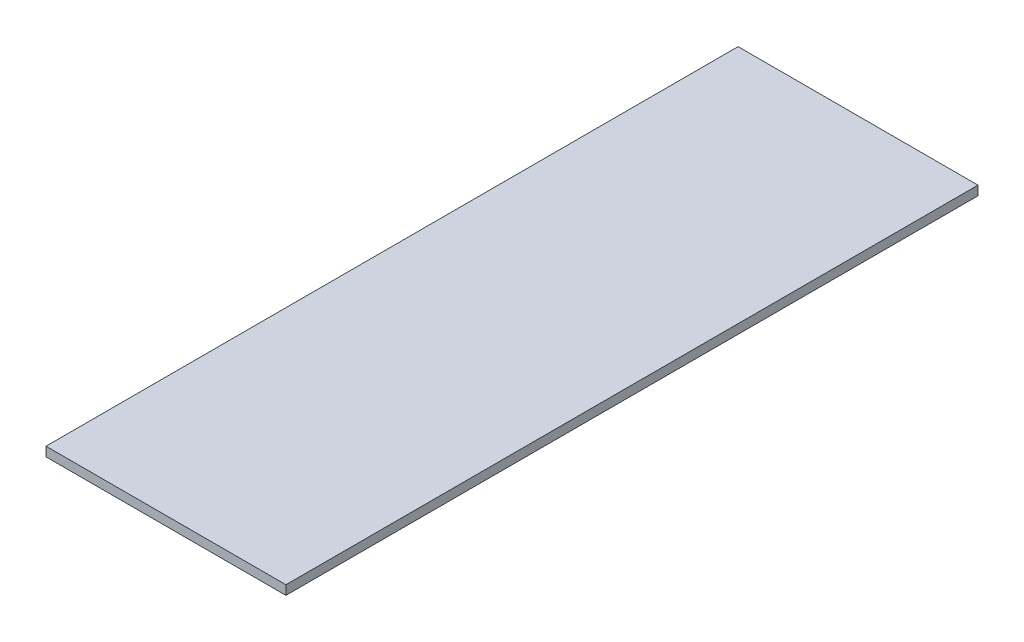
ISO-10303-21;
HEADER;
FILE_DESCRIPTION(('STEP AP214'),'2;1');
FILE_NAME('part.step','',(''),(''),'','','');
FILE_SCHEMA(('AUTOMOTIVE_DESIGN { 1 0 10303 214 1 1 1 1 }'));
ENDSEC;
DATA;
#1=APPLICATION_CONTEXT('core data for automotive mechanical design processes');
#2=APPLICATION_PROTOCOL_DEFINITION('international standard','automotive_design',2000,#1);
#3=PRODUCT_CONTEXT('',#1,'mechanical');
#4=PRODUCT('Part','Part','',(#3));
#5=PRODUCT_RELATED_PRODUCT_CATEGORY('part','',(#4));
#6=PRODUCT_DEFINITION_FORMATION('','',#4);
#7=PRODUCT_DEFINITION_CONTEXT('part definition',#1,'design');
#8=PRODUCT_DEFINITION('design','',#6,#7);
#9=PRODUCT_DEFINITION_SHAPE('','',#8);
#10=(LENGTH_UNIT() NAMED_UNIT(*) SI_UNIT(.MILLI.,.METRE.));
#11=(NAMED_UNIT(*) PLANE_ANGLE_UNIT() SI_UNIT($,.RADIAN.));
#12=(NAMED_UNIT(*) SI_UNIT($,.STERADIAN.) SOLID_ANGLE_UNIT());
#13=UNCERTAINTY_MEASURE_WITH_UNIT(LENGTH_MEASURE(1.E-05),#10,'distance_accuracy_value','');
#14=(GEOMETRIC_REPRESENTATION_CONTEXT(3) GLOBAL_UNCERTAINTY_ASSIGNED_CONTEXT((#13)) GLOBAL_UNIT_ASSIGNED_CONTEXT((#10,
#11,#12)) REPRESENTATION_CONTEXT('',''));
#15=CARTESIAN_POINT('',(0.,0.,0.));
#16=DIRECTION('',(0.,0.,1.));
#17=DIRECTION('',(1.,0.,0.));
#18=AXIS2_PLACEMENT_3D('',#15,#16,#17);
#19=CARTESIAN_POINT('',(-13.,26.5,-30.));
#20=DIRECTION('',(1.,0.,0.));
#21=DIRECTION('',(0.,0.,-1.));
#22=AXIS2_PLACEMENT_3D('',#19,#20,#21);
#23=PLANE('',#22);
#24=DIRECTION('',(0.,0.,1.));
#25=VECTOR('',#24,1.);
#26=CARTESIAN_POINT('',(-13.,25.5,-30.));
#27=LINE('',#26,#25);
#28=CARTESIAN_POINT('',(-13.,25.5,-30.));
#29=VERTEX_POINT('',#28);
#30=CARTESIAN_POINT('',(-13.,25.5,45.));
#31=VERTEX_POINT('',#30);
#32=EDGE_CURVE('E100',#29,#31,#27,.T.);
#33=ORIENTED_EDGE('',*,*,#32,.T.);
#34=DIRECTION('',(0.,-1.,0.));
#35=VECTOR('',#34,1.);
#36=CARTESIAN_POINT('',(-13.,26.5,45.));
#37=LINE('',#36,#35);
#38=CARTESIAN_POINT('',(-13.,26.5,45.));
#39=VERTEX_POINT('',#38);
#40=EDGE_CURVE('E11',#39,#31,#37,.T.);
#41=ORIENTED_EDGE('',*,*,#40,.F.);
#42=DIRECTION('',(0.,0.,1.));
#43=VECTOR('',#42,1.);
#44=CARTESIAN_POINT('',(-13.,26.5,-30.));
#45=LINE('',#44,#43);
#46=CARTESIAN_POINT('',(-13.,26.5,-30.));
#47=VERTEX_POINT('',#46);
#48=EDGE_CURVE('E86',#47,#39,#45,.T.);
#49=ORIENTED_EDGE('',*,*,#48,.F.);
#50=DIRECTION('',(0.,-1.,0.));
#51=VECTOR('',#50,1.);
#52=CARTESIAN_POINT('',(-13.,26.5,-30.));
#53=LINE('',#52,#51);
#54=EDGE_CURVE('E53',#47,#29,#53,.T.);
#55=ORIENTED_EDGE('',*,*,#54,.T.);
#56=EDGE_LOOP('',(#33,#41,#49,#55));
#57=FACE_BOUND('',#56,.T.);
#58=ADVANCED_FACE('F37',(#57),#23,.F.);
#59=CARTESIAN_POINT('',(-13.,26.5,45.));
#60=DIRECTION('',(0.,0.,-1.));
#61=DIRECTION('',(-1.,0.,0.));
#62=AXIS2_PLACEMENT_3D('',#59,#60,#61);
#63=PLANE('',#62);
#64=DIRECTION('',(1.,0.,0.));
#65=VECTOR('',#64,1.);
#66=CARTESIAN_POINT('',(-13.,25.5,45.));
#67=LINE('',#66,#65);
#68=CARTESIAN_POINT('',(13.,25.5,45.));
#69=VERTEX_POINT('',#68);
#70=EDGE_CURVE('E91',#31,#69,#67,.T.);
#71=ORIENTED_EDGE('',*,*,#70,.T.);
#72=DIRECTION('',(0.,-1.,0.));
#73=VECTOR('',#72,1.);
#74=CARTESIAN_POINT('',(13.,26.5,45.));
#75=LINE('',#74,#73);
#76=CARTESIAN_POINT('',(13.,26.5,45.));
#77=VERTEX_POINT('',#76);
#78=EDGE_CURVE('E45',#77,#69,#75,.T.);
#79=ORIENTED_EDGE('',*,*,#78,.F.);
#80=DIRECTION('',(1.,0.,0.));
#81=VECTOR('',#80,1.);
#82=CARTESIAN_POINT('',(-13.,26.5,45.));
#83=LINE('',#82,#81);
#84=EDGE_CURVE('E78',#39,#77,#83,.T.);
#85=ORIENTED_EDGE('',*,*,#84,.F.);
#86=ORIENTED_EDGE('',*,*,#40,.T.);
#87=EDGE_LOOP('',(#71,#79,#85,#86));
#88=FACE_BOUND('',#87,.T.);
#89=ADVANCED_FACE('F90',(#88),#63,.F.);
#90=CARTESIAN_POINT('',(13.,26.5,-30.));
#91=DIRECTION('',(1.,0.,0.));
#92=DIRECTION('',(0.,0.,-1.));
#93=AXIS2_PLACEMENT_3D('',#90,#91,#92);
#94=PLANE('',#93);
#95=DIRECTION('',(0.,0.,1.));
#96=VECTOR('',#95,1.);
#97=CARTESIAN_POINT('',(13.,25.5,-30.));
#98=LINE('',#97,#96);
#99=CARTESIAN_POINT('',(13.,25.5,-30.));
#100=VERTEX_POINT('',#99);
#101=EDGE_CURVE('E103',#100,#69,#98,.T.);
#102=ORIENTED_EDGE('',*,*,#101,.F.);
#103=DIRECTION('',(0.,-1.,0.));
#104=VECTOR('',#103,1.);
#105=CARTESIAN_POINT('',(13.,26.5,-30.));
#106=LINE('',#105,#104);
#107=CARTESIAN_POINT('',(13.,26.5,-30.));
#108=VERTEX_POINT('',#107);
#109=EDGE_CURVE('E67',#108,#100,#106,.T.);
#110=ORIENTED_EDGE('',*,*,#109,.F.);
#111=DIRECTION('',(0.,0.,1.));
#112=VECTOR('',#111,1.);
#113=CARTESIAN_POINT('',(13.,26.5,-30.));
#114=LINE('',#113,#112);
#115=EDGE_CURVE('E85',#108,#77,#114,.T.);
#116=ORIENTED_EDGE('',*,*,#115,.T.);
#117=ORIENTED_EDGE('',*,*,#78,.T.);
#118=EDGE_LOOP('',(#102,#110,#116,#117));
#119=FACE_BOUND('',#118,.T.);
#120=ADVANCED_FACE('F94',(#119),#94,.T.);
#121=CARTESIAN_POINT('',(-13.,26.5,-30.));
#122=DIRECTION('',(0.,0.,-1.));
#123=DIRECTION('',(-1.,0.,0.));
#124=AXIS2_PLACEMENT_3D('',#121,#122,#123);
#125=PLANE('',#124);
#126=DIRECTION('',(1.,0.,0.));
#127=VECTOR('',#126,1.);
#128=CARTESIAN_POINT('',(-13.,25.5,-30.));
#129=LINE('',#128,#127);
#130=EDGE_CURVE('E105',#29,#100,#129,.T.);
#131=ORIENTED_EDGE('',*,*,#130,.F.);
#132=ORIENTED_EDGE('',*,*,#54,.F.);
#133=DIRECTION('',(1.,0.,0.));
#134=VECTOR('',#133,1.);
#135=CARTESIAN_POINT('',(-13.,26.5,-30.));
#136=LINE('',#135,#134);
#137=EDGE_CURVE('E95',#47,#108,#136,.T.);
#138=ORIENTED_EDGE('',*,*,#137,.T.);
#139=ORIENTED_EDGE('',*,*,#109,.T.);
#140=EDGE_LOOP('',(#131,#132,#138,#139));
#141=FACE_BOUND('',#140,.T.);
#142=ADVANCED_FACE('F111',(#141),#125,.T.);
#143=CARTESIAN_POINT('',(0.,26.5,0.));
#144=DIRECTION('',(0.,1.,0.));
#145=DIRECTION('',(0.,0.,1.));
#146=AXIS2_PLACEMENT_3D('',#143,#144,#145);
#147=PLANE('',#146);
#148=ORIENTED_EDGE('',*,*,#48,.T.);
#149=ORIENTED_EDGE('',*,*,#84,.T.);
#150=ORIENTED_EDGE('',*,*,#115,.F.);
#151=ORIENTED_EDGE('',*,*,#137,.F.);
#152=EDGE_LOOP('',(#148,#149,#150,#151));
#153=FACE_BOUND('',#152,.T.);
#154=ADVANCED_FACE('F82',(#153),#147,.T.);
#155=CARTESIAN_POINT('',(0.,25.5,0.));
#156=DIRECTION('',(0.,1.,0.));
#157=DIRECTION('',(0.,0.,1.));
#158=AXIS2_PLACEMENT_3D('',#155,#156,#157);
#159=PLANE('',#158);
#160=ORIENTED_EDGE('',*,*,#32,.F.);
#161=ORIENTED_EDGE('',*,*,#130,.T.);
#162=ORIENTED_EDGE('',*,*,#101,.T.);
#163=ORIENTED_EDGE('',*,*,#70,.F.);
#164=EDGE_LOOP('',(#160,#161,#162,#163));
#165=FACE_BOUND('',#164,.T.);
#166=ADVANCED_FACE('F110',(#165),#159,.F.);
#167=CLOSED_SHELL('',(#58,#89,#120,#142,#154,#166));
#168=MANIFOLD_SOLID_BREP('B2',#167);
#169=ADVANCED_BREP_SHAPE_REPRESENTATION('',(#18,#168),#14);
#170=SHAPE_DEFINITION_REPRESENTATION(#9,#169);
ENDSEC;
END-ISO-10303-21;
